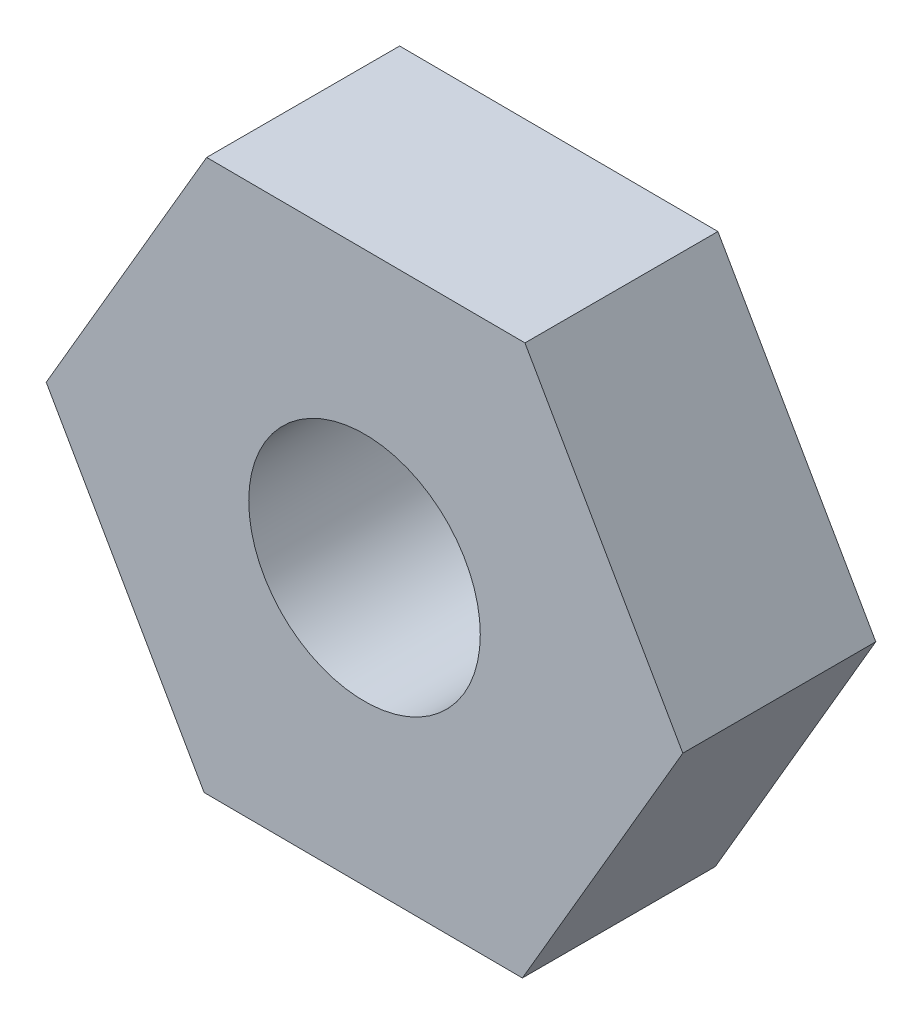
ISO-10303-21;
HEADER;
FILE_DESCRIPTION(('STEP AP214'),'2;1');
FILE_NAME('part.step','',(''),(''),'','','');
FILE_SCHEMA(('AUTOMOTIVE_DESIGN { 1 0 10303 214 1 1 1 1 }'));
ENDSEC;
DATA;
#1=APPLICATION_CONTEXT('core data for automotive mechanical design processes');
#2=APPLICATION_PROTOCOL_DEFINITION('international standard','automotive_design',2000,#1);
#3=PRODUCT_CONTEXT('',#1,'mechanical');
#4=PRODUCT('Part','Part','',(#3));
#5=PRODUCT_RELATED_PRODUCT_CATEGORY('part','',(#4));
#6=PRODUCT_DEFINITION_FORMATION('','',#4);
#7=PRODUCT_DEFINITION_CONTEXT('part definition',#1,'design');
#8=PRODUCT_DEFINITION('design','',#6,#7);
#9=PRODUCT_DEFINITION_SHAPE('','',#8);
#10=(LENGTH_UNIT() NAMED_UNIT(*) SI_UNIT(.MILLI.,.METRE.));
#11=(NAMED_UNIT(*) PLANE_ANGLE_UNIT() SI_UNIT($,.RADIAN.));
#12=(NAMED_UNIT(*) SI_UNIT($,.STERADIAN.) SOLID_ANGLE_UNIT());
#13=UNCERTAINTY_MEASURE_WITH_UNIT(LENGTH_MEASURE(1.E-05),#10,'distance_accuracy_value','');
#14=(GEOMETRIC_REPRESENTATION_CONTEXT(3) GLOBAL_UNCERTAINTY_ASSIGNED_CONTEXT((#13)) GLOBAL_UNIT_ASSIGNED_CONTEXT((#10,
#11,#12)) REPRESENTATION_CONTEXT('',''));
#15=CARTESIAN_POINT('',(0.,0.,0.));
#16=DIRECTION('',(0.,0.,1.));
#17=DIRECTION('',(1.,0.,0.));
#18=AXIS2_PLACEMENT_3D('',#15,#16,#17);
#19=CARTESIAN_POINT('',(0.,0.,3.5));
#20=DIRECTION('',(0.,0.,1.));
#21=DIRECTION('',(1.,0.,0.));
#22=AXIS2_PLACEMENT_3D('',#19,#20,#21);
#23=PLANE('',#22);
#24=DIRECTION('',(-0.999989108419823,0.00466723062721316,0.));
#25=VECTOR('',#24,1.);
#26=CARTESIAN_POINT('',(2.91005605780046,4.98647240780416,3.5));
#27=LINE('',#26,#25);
#28=CARTESIAN_POINT('',(2.91005605780046,4.98647240780416,3.5));
#29=VERTEX_POINT('',#28);
#30=CARTESIAN_POINT('',(-2.86338375152833,5.01341867639407,3.5));
#31=VERTEX_POINT('',#30);
#32=EDGE_CURVE('E130',#29,#31,#27,.T.);
#33=ORIENTED_EDGE('',*,*,#32,.T.);
#34=DIRECTION('',(-0.504036494498399,-0.863682356085711,0.));
#35=VECTOR('',#34,1.);
#36=CARTESIAN_POINT('',(-2.86338375152833,5.01341867639407,3.5));
#37=LINE('',#36,#35);
#38=CARTESIAN_POINT('',(-5.77343980932879,0.0269462685899158,3.5));
#39=VERTEX_POINT('',#38);
#40=EDGE_CURVE('E88',#31,#39,#37,.T.);
#41=ORIENTED_EDGE('',*,*,#40,.T.);
#42=DIRECTION('',(0.495952613921424,-0.868349586712924,0.));
#43=VECTOR('',#42,1.);
#44=CARTESIAN_POINT('',(-5.77343980932879,0.0269462685899158,3.5));
#45=LINE('',#44,#43);
#46=CARTESIAN_POINT('',(-2.91005605780046,-4.98647240780415,3.5));
#47=VERTEX_POINT('',#46);
#48=EDGE_CURVE('E101',#39,#47,#45,.T.);
#49=ORIENTED_EDGE('',*,*,#48,.T.);
#50=DIRECTION('',(0.999989108419823,-0.00466723062721301,0.));
#51=VECTOR('',#50,1.);
#52=CARTESIAN_POINT('',(-2.91005605780046,-4.98647240780415,3.5));
#53=LINE('',#52,#51);
#54=CARTESIAN_POINT('',(2.86338375152833,-5.01341867639407,3.5));
#55=VERTEX_POINT('',#54);
#56=EDGE_CURVE('E95',#47,#55,#53,.T.);
#57=ORIENTED_EDGE('',*,*,#56,.T.);
#58=DIRECTION('',(0.504036494498399,0.863682356085711,0.));
#59=VECTOR('',#58,1.);
#60=CARTESIAN_POINT('',(2.86338375152833,-5.01341867639407,3.5));
#61=LINE('',#60,#59);
#62=CARTESIAN_POINT('',(5.77343980932879,-0.026946268589915,3.5));
#63=VERTEX_POINT('',#62);
#64=EDGE_CURVE('E99',#55,#63,#61,.T.);
#65=ORIENTED_EDGE('',*,*,#64,.T.);
#66=DIRECTION('',(-0.495952613921424,0.868349586712924,0.));
#67=VECTOR('',#66,1.);
#68=CARTESIAN_POINT('',(5.77343980932879,-0.026946268589915,3.5));
#69=LINE('',#68,#67);
#70=EDGE_CURVE('E51',#63,#29,#69,.T.);
#71=ORIENTED_EDGE('',*,*,#70,.T.);
#72=EDGE_LOOP('',(#33,#41,#49,#57,#65,#71));
#73=FACE_BOUND('',#72,.T.);
#74=CARTESIAN_POINT('',(0.,0.,3.5));
#75=DIRECTION('',(0.,0.,1.));
#76=DIRECTION('',(1.,0.,0.));
#77=AXIS2_PLACEMENT_3D('',#74,#75,#76);
#78=CIRCLE('',#77,2.1);
#79=CARTESIAN_POINT('',(2.1,0.,3.5));
#80=VERTEX_POINT('',#79);
#81=EDGE_CURVE('E123',#80,#80,#78,.T.);
#82=ORIENTED_EDGE('',*,*,#81,.F.);
#83=EDGE_LOOP('',(#82));
#84=FACE_BOUND('',#83,.T.);
#85=ADVANCED_FACE('F34',(#73,#84),#23,.T.);
#86=CARTESIAN_POINT('',(0.,0.,0.));
#87=DIRECTION('',(0.,0.,1.));
#88=DIRECTION('',(1.,0.,0.));
#89=AXIS2_PLACEMENT_3D('',#86,#87,#88);
#90=PLANE('',#89);
#91=DIRECTION('',(-0.999989108419823,0.00466723062721316,0.));
#92=VECTOR('',#91,1.);
#93=CARTESIAN_POINT('',(2.91005605780046,4.98647240780416,0.));
#94=LINE('',#93,#92);
#95=CARTESIAN_POINT('',(2.91005605780046,4.98647240780416,0.));
#96=VERTEX_POINT('',#95);
#97=CARTESIAN_POINT('',(-2.86338375152833,5.01341867639407,0.));
#98=VERTEX_POINT('',#97);
#99=EDGE_CURVE('E119',#96,#98,#94,.T.);
#100=ORIENTED_EDGE('',*,*,#99,.F.);
#101=DIRECTION('',(-0.495952613921424,0.868349586712924,0.));
#102=VECTOR('',#101,1.);
#103=CARTESIAN_POINT('',(5.77343980932879,-0.026946268589915,0.));
#104=LINE('',#103,#102);
#105=CARTESIAN_POINT('',(5.77343980932879,-0.026946268589915,0.));
#106=VERTEX_POINT('',#105);
#107=EDGE_CURVE('E80',#106,#96,#104,.T.);
#108=ORIENTED_EDGE('',*,*,#107,.F.);
#109=DIRECTION('',(0.504036494498399,0.863682356085711,0.));
#110=VECTOR('',#109,1.);
#111=CARTESIAN_POINT('',(2.86338375152833,-5.01341867639407,0.));
#112=LINE('',#111,#110);
#113=CARTESIAN_POINT('',(2.86338375152833,-5.01341867639407,0.));
#114=VERTEX_POINT('',#113);
#115=EDGE_CURVE('E74',#114,#106,#112,.T.);
#116=ORIENTED_EDGE('',*,*,#115,.F.);
#117=DIRECTION('',(0.999989108419823,-0.00466723062721301,0.));
#118=VECTOR('',#117,1.);
#119=CARTESIAN_POINT('',(-2.91005605780046,-4.98647240780415,0.));
#120=LINE('',#119,#118);
#121=CARTESIAN_POINT('',(-2.91005605780046,-4.98647240780415,0.));
#122=VERTEX_POINT('',#121);
#123=EDGE_CURVE('E109',#122,#114,#120,.T.);
#124=ORIENTED_EDGE('',*,*,#123,.F.);
#125=DIRECTION('',(0.495952613921424,-0.868349586712924,0.));
#126=VECTOR('',#125,1.);
#127=CARTESIAN_POINT('',(-5.77343980932879,0.0269462685899158,0.));
#128=LINE('',#127,#126);
#129=CARTESIAN_POINT('',(-5.77343980932879,0.0269462685899158,0.));
#130=VERTEX_POINT('',#129);
#131=EDGE_CURVE('E125',#130,#122,#128,.T.);
#132=ORIENTED_EDGE('',*,*,#131,.F.);
#133=DIRECTION('',(-0.504036494498399,-0.863682356085711,0.));
#134=VECTOR('',#133,1.);
#135=CARTESIAN_POINT('',(-2.86338375152833,5.01341867639407,0.));
#136=LINE('',#135,#134);
#137=EDGE_CURVE('E122',#98,#130,#136,.T.);
#138=ORIENTED_EDGE('',*,*,#137,.F.);
#139=EDGE_LOOP('',(#100,#108,#116,#124,#132,#138));
#140=FACE_BOUND('',#139,.T.);
#141=CARTESIAN_POINT('',(0.,0.,0.));
#142=DIRECTION('',(0.,0.,1.));
#143=DIRECTION('',(1.,0.,0.));
#144=AXIS2_PLACEMENT_3D('',#141,#142,#143);
#145=CIRCLE('',#144,2.1);
#146=CARTESIAN_POINT('',(2.1,0.,0.));
#147=VERTEX_POINT('',#146);
#148=EDGE_CURVE('E223',#147,#147,#145,.T.);
#149=ORIENTED_EDGE('',*,*,#148,.T.);
#150=EDGE_LOOP('',(#149));
#151=FACE_BOUND('',#150,.T.);
#152=ADVANCED_FACE('F139',(#140,#151),#90,.F.);
#153=CARTESIAN_POINT('',(2.91005605780046,4.98647240780416,3.5));
#154=DIRECTION('',(-0.00466723062721316,-0.999989108419823,0.));
#155=DIRECTION('',(0.999989108419823,-0.00466723062721316,0.));
#156=AXIS2_PLACEMENT_3D('',#153,#154,#155);
#157=PLANE('',#156);
#158=ORIENTED_EDGE('',*,*,#99,.T.);
#159=DIRECTION('',(0.,0.,-1.));
#160=VECTOR('',#159,1.);
#161=CARTESIAN_POINT('',(-2.86338375152833,5.01341867639407,3.5));
#162=LINE('',#161,#160);
#163=EDGE_CURVE('E11',#31,#98,#162,.T.);
#164=ORIENTED_EDGE('',*,*,#163,.F.);
#165=ORIENTED_EDGE('',*,*,#32,.F.);
#166=DIRECTION('',(0.,0.,-1.));
#167=VECTOR('',#166,1.);
#168=CARTESIAN_POINT('',(2.91005605780046,4.98647240780416,3.5));
#169=LINE('',#168,#167);
#170=EDGE_CURVE('E115',#29,#96,#169,.T.);
#171=ORIENTED_EDGE('',*,*,#170,.T.);
#172=EDGE_LOOP('',(#158,#164,#165,#171));
#173=FACE_BOUND('',#172,.T.);
#174=ADVANCED_FACE('F36',(#173),#157,.F.);
#175=CARTESIAN_POINT('',(-2.86338375152833,5.01341867639407,3.5));
#176=DIRECTION('',(0.863682356085711,-0.504036494498399,0.));
#177=DIRECTION('',(0.504036494498399,0.863682356085711,0.));
#178=AXIS2_PLACEMENT_3D('',#175,#176,#177);
#179=PLANE('',#178);
#180=ORIENTED_EDGE('',*,*,#137,.T.);
#181=DIRECTION('',(0.,0.,-1.));
#182=VECTOR('',#181,1.);
#183=CARTESIAN_POINT('',(-5.77343980932879,0.0269462685899158,3.5));
#184=LINE('',#183,#182);
#185=EDGE_CURVE('E43',#39,#130,#184,.T.);
#186=ORIENTED_EDGE('',*,*,#185,.F.);
#187=ORIENTED_EDGE('',*,*,#40,.F.);
#188=ORIENTED_EDGE('',*,*,#163,.T.);
#189=EDGE_LOOP('',(#180,#186,#187,#188));
#190=FACE_BOUND('',#189,.T.);
#191=ADVANCED_FACE('F164',(#190),#179,.F.);
#192=CARTESIAN_POINT('',(-5.77343980932879,0.0269462685899158,3.5));
#193=DIRECTION('',(0.868349586712925,0.495952613921424,0.));
#194=DIRECTION('',(-0.495952613921424,0.868349586712925,0.));
#195=AXIS2_PLACEMENT_3D('',#192,#193,#194);
#196=PLANE('',#195);
#197=ORIENTED_EDGE('',*,*,#131,.T.);
#198=DIRECTION('',(0.,0.,-1.));
#199=VECTOR('',#198,1.);
#200=CARTESIAN_POINT('',(-2.91005605780046,-4.98647240780415,3.5));
#201=LINE('',#200,#199);
#202=EDGE_CURVE('E110',#47,#122,#201,.T.);
#203=ORIENTED_EDGE('',*,*,#202,.F.);
#204=ORIENTED_EDGE('',*,*,#48,.F.);
#205=ORIENTED_EDGE('',*,*,#185,.T.);
#206=EDGE_LOOP('',(#197,#203,#204,#205));
#207=FACE_BOUND('',#206,.T.);
#208=ADVANCED_FACE('F136',(#207),#196,.F.);
#209=CARTESIAN_POINT('',(-2.91005605780046,-4.98647240780415,3.5));
#210=DIRECTION('',(0.00466723062721301,0.999989108419823,0.));
#211=DIRECTION('',(-0.999989108419823,0.00466723062721301,0.));
#212=AXIS2_PLACEMENT_3D('',#209,#210,#211);
#213=PLANE('',#212);
#214=ORIENTED_EDGE('',*,*,#123,.T.);
#215=DIRECTION('',(0.,0.,-1.));
#216=VECTOR('',#215,1.);
#217=CARTESIAN_POINT('',(2.86338375152833,-5.01341867639407,3.5));
#218=LINE('',#217,#216);
#219=EDGE_CURVE('E106',#55,#114,#218,.T.);
#220=ORIENTED_EDGE('',*,*,#219,.F.);
#221=ORIENTED_EDGE('',*,*,#56,.F.);
#222=ORIENTED_EDGE('',*,*,#202,.T.);
#223=EDGE_LOOP('',(#214,#220,#221,#222));
#224=FACE_BOUND('',#223,.T.);
#225=ADVANCED_FACE('F107',(#224),#213,.F.);
#226=CARTESIAN_POINT('',(2.86338375152833,-5.01341867639407,3.5));
#227=DIRECTION('',(-0.863682356085711,0.504036494498399,0.));
#228=DIRECTION('',(-0.504036494498399,-0.863682356085712,0.));
#229=AXIS2_PLACEMENT_3D('',#226,#227,#228);
#230=PLANE('',#229);
#231=ORIENTED_EDGE('',*,*,#115,.T.);
#232=DIRECTION('',(0.,0.,-1.));
#233=VECTOR('',#232,1.);
#234=CARTESIAN_POINT('',(5.77343980932879,-0.026946268589915,3.5));
#235=LINE('',#234,#233);
#236=EDGE_CURVE('E111',#63,#106,#235,.T.);
#237=ORIENTED_EDGE('',*,*,#236,.F.);
#238=ORIENTED_EDGE('',*,*,#64,.F.);
#239=ORIENTED_EDGE('',*,*,#219,.T.);
#240=EDGE_LOOP('',(#231,#237,#238,#239));
#241=FACE_BOUND('',#240,.T.);
#242=ADVANCED_FACE('F113',(#241),#230,.F.);
#243=CARTESIAN_POINT('',(5.77343980932879,-0.026946268589915,3.5));
#244=DIRECTION('',(-0.868349586712925,-0.495952613921424,0.));
#245=DIRECTION('',(0.495952613921424,-0.868349586712925,0.));
#246=AXIS2_PLACEMENT_3D('',#243,#244,#245);
#247=PLANE('',#246);
#248=ORIENTED_EDGE('',*,*,#107,.T.);
#249=ORIENTED_EDGE('',*,*,#170,.F.);
#250=ORIENTED_EDGE('',*,*,#70,.F.);
#251=ORIENTED_EDGE('',*,*,#236,.T.);
#252=EDGE_LOOP('',(#248,#249,#250,#251));
#253=FACE_BOUND('',#252,.T.);
#254=ADVANCED_FACE('F144',(#253),#247,.F.);
#255=CARTESIAN_POINT('',(0.,0.,3.5));
#256=DIRECTION('',(0.,0.,-1.));
#257=DIRECTION('',(-1.,0.,0.));
#258=AXIS2_PLACEMENT_3D('',#255,#256,#257);
#259=CYLINDRICAL_SURFACE('',#258,2.1);
#260=ORIENTED_EDGE('',*,*,#81,.T.);
#261=EDGE_LOOP('',(#260));
#262=FACE_BOUND('',#261,.T.);
#263=ORIENTED_EDGE('',*,*,#148,.F.);
#264=EDGE_LOOP('',(#263));
#265=FACE_BOUND('',#264,.T.);
#266=ADVANCED_FACE('F146',(#262,#265),#259,.F.);
#267=CLOSED_SHELL('',(#85,#152,#174,#191,#208,#225,#242,#254,#266));
#268=MANIFOLD_SOLID_BREP('B2',#267);
#269=ADVANCED_BREP_SHAPE_REPRESENTATION('',(#18,#268),#14);
#270=SHAPE_DEFINITION_REPRESENTATION(#9,#269);
ENDSEC;
END-ISO-10303-21;
